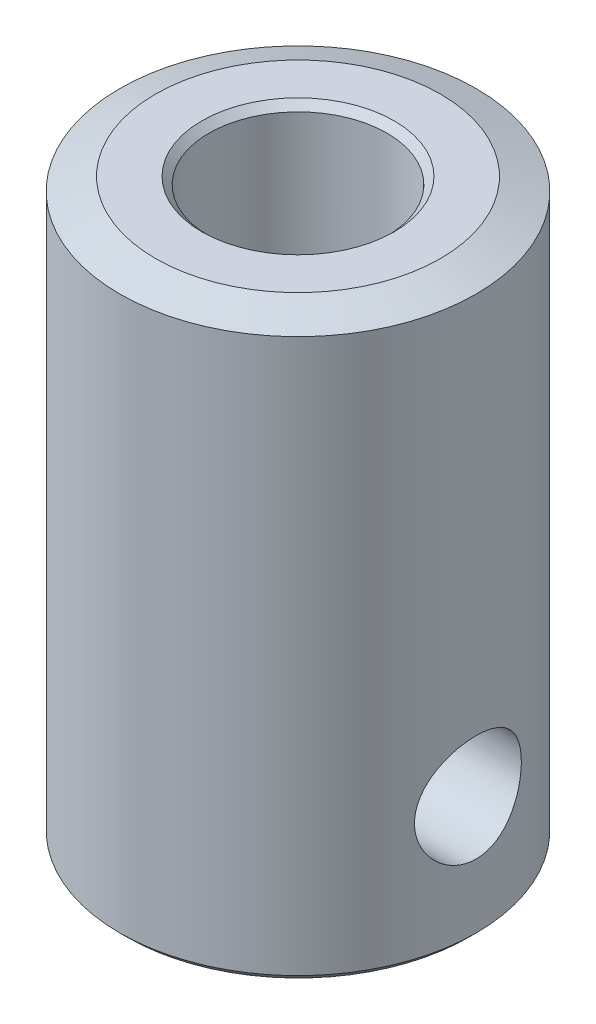
ISO-10303-21;
HEADER;
FILE_DESCRIPTION(('STEP AP214'),'2;1');
FILE_NAME('part.step','',(''),(''),'','','');
FILE_SCHEMA(('AUTOMOTIVE_DESIGN { 1 0 10303 214 1 1 1 1 }'));
ENDSEC;
DATA;
#1=APPLICATION_CONTEXT('core data for automotive mechanical design processes');
#2=APPLICATION_PROTOCOL_DEFINITION('international standard','automotive_design',2000,#1);
#3=PRODUCT_CONTEXT('',#1,'mechanical');
#4=PRODUCT('Part','Part','',(#3));
#5=PRODUCT_RELATED_PRODUCT_CATEGORY('part','',(#4));
#6=PRODUCT_DEFINITION_FORMATION('','',#4);
#7=PRODUCT_DEFINITION_CONTEXT('part definition',#1,'design');
#8=PRODUCT_DEFINITION('design','',#6,#7);
#9=PRODUCT_DEFINITION_SHAPE('','',#8);
#10=(LENGTH_UNIT() NAMED_UNIT(*) SI_UNIT(.MILLI.,.METRE.));
#11=(NAMED_UNIT(*) PLANE_ANGLE_UNIT() SI_UNIT($,.RADIAN.));
#12=(NAMED_UNIT(*) SI_UNIT($,.STERADIAN.) SOLID_ANGLE_UNIT());
#13=UNCERTAINTY_MEASURE_WITH_UNIT(LENGTH_MEASURE(1.E-05),#10,'distance_accuracy_value','');
#14=(GEOMETRIC_REPRESENTATION_CONTEXT(3) GLOBAL_UNCERTAINTY_ASSIGNED_CONTEXT((#13)) GLOBAL_UNIT_ASSIGNED_CONTEXT((#10,
#11,#12)) REPRESENTATION_CONTEXT('',''));
#15=CARTESIAN_POINT('',(0.,0.,0.));
#16=DIRECTION('',(0.,0.,1.));
#17=DIRECTION('',(1.,0.,0.));
#18=AXIS2_PLACEMENT_3D('',#15,#16,#17);
#19=CARTESIAN_POINT('',(0.,16.1,0.));
#20=DIRECTION('',(0.,1.,0.));
#21=DIRECTION('',(0.,0.,1.));
#22=AXIS2_PLACEMENT_3D('',#19,#20,#21);
#23=PLANE('',#22);
#24=CARTESIAN_POINT('',(0.,16.1,0.));
#25=DIRECTION('',(0.,1.,0.));
#26=DIRECTION('',(0.,0.,1.));
#27=AXIS2_PLACEMENT_3D('',#24,#25,#26);
#28=CIRCLE('',#27,3.99999999999999);
#29=CARTESIAN_POINT('',(0.,16.1,3.99999999999999));
#30=VERTEX_POINT('',#29);
#31=EDGE_CURVE('E38',#30,#30,#28,.T.);
#32=ORIENTED_EDGE('',*,*,#31,.T.);
#33=EDGE_LOOP('',(#32));
#34=FACE_BOUND('',#33,.T.);
#35=CARTESIAN_POINT('',(0.,16.1,0.));
#36=DIRECTION('',(0.,1.,0.));
#37=DIRECTION('',(0.,0.,1.));
#38=AXIS2_PLACEMENT_3D('',#35,#36,#37);
#39=CIRCLE('',#38,2.7);
#40=CARTESIAN_POINT('',(0.,16.1,2.7));
#41=VERTEX_POINT('',#40);
#42=EDGE_CURVE('E54',#41,#41,#39,.F.);
#43=ORIENTED_EDGE('',*,*,#42,.T.);
#44=EDGE_LOOP('',(#43));
#45=FACE_BOUND('',#44,.T.);
#46=ADVANCED_FACE('F31',(#34,#45),#23,.T.);
#47=CARTESIAN_POINT('',(0.,0.,0.));
#48=DIRECTION('',(0.,1.,0.));
#49=DIRECTION('',(0.,0.,1.));
#50=AXIS2_PLACEMENT_3D('',#47,#48,#49);
#51=PLANE('',#50);
#52=CARTESIAN_POINT('',(0.,0.,0.));
#53=DIRECTION('',(0.,1.,0.));
#54=DIRECTION('',(0.,0.,1.));
#55=AXIS2_PLACEMENT_3D('',#52,#53,#54);
#56=CIRCLE('',#55,2.7);
#57=CARTESIAN_POINT('',(0.,0.,2.7));
#58=VERTEX_POINT('',#57);
#59=EDGE_CURVE('E46',#58,#58,#56,.T.);
#60=ORIENTED_EDGE('',*,*,#59,.T.);
#61=EDGE_LOOP('',(#60));
#62=FACE_BOUND('',#61,.T.);
#63=CARTESIAN_POINT('',(0.,0.,0.));
#64=DIRECTION('',(0.,1.,0.));
#65=DIRECTION('',(0.,0.,1.));
#66=AXIS2_PLACEMENT_3D('',#63,#64,#65);
#67=CIRCLE('',#66,4.8);
#68=CARTESIAN_POINT('',(0.,0.,4.8));
#69=VERTEX_POINT('',#68);
#70=EDGE_CURVE('E51',#69,#69,#67,.F.);
#71=ORIENTED_EDGE('',*,*,#70,.T.);
#72=EDGE_LOOP('',(#71));
#73=FACE_BOUND('',#72,.T.);
#74=ADVANCED_FACE('F109',(#62,#73),#51,.F.);
#75=CARTESIAN_POINT('',(0.,16.1,0.));
#76=DIRECTION('',(0.,-1.,0.));
#77=DIRECTION('',(0.,0.,-1.));
#78=AXIS2_PLACEMENT_3D('',#75,#76,#77);
#79=CYLINDRICAL_SURFACE('',#78,5.);
#80=CARTESIAN_POINT('',(4.76969600708473,3.5,-1.49999999999998));
#81=CARTESIAN_POINT('',(4.7696968572698,3.5821945479424,-1.49999897633762));
#82=CARTESIAN_POINT('',(4.77184390209069,3.66439922414403,-1.4932210816714));
#83=CARTESIAN_POINT('',(4.780165783029,3.82640524959194,-1.46635844446747));
#84=CARTESIAN_POINT('',(4.78634196493468,3.90620578650147,-1.44626925573576));
#85=CARTESIAN_POINT('',(4.80196102485633,4.06103472827173,-1.39352753269954));
#86=CARTESIAN_POINT('',(4.81139846703233,4.13607082963309,-1.36089589394242));
#87=CARTESIAN_POINT('',(4.83246932547567,4.2796219339953,-1.28406421917927));
#88=CARTESIAN_POINT('',(4.8441030704102,4.34813595868444,-1.23986245137051));
#89=CARTESIAN_POINT('',(4.86866862185766,4.47886639057738,-1.13964754141625));
#90=CARTESIAN_POINT('',(4.88162808311636,4.54084589794629,-1.08333207175805));
#91=CARTESIAN_POINT('',(4.90714861936757,4.65463795132251,-0.961136237579581));
#92=CARTESIAN_POINT('',(4.91970964297705,4.70644919044988,-0.895254645461094));
#93=CARTESIAN_POINT('',(4.94333214579389,4.79946269983331,-0.754111437793673));
#94=CARTESIAN_POINT('',(4.95435724342404,4.84042342444281,-0.678684021335797));
#95=CARTESIAN_POINT('',(4.97334435920684,4.90898725904276,-0.521624645369336));
#96=CARTESIAN_POINT('',(4.98130703789496,4.93659324985745,-0.439994028387894));
#97=CARTESIAN_POINT('',(4.99307646003589,4.97688000109051,-0.275323852630812));
#98=CARTESIAN_POINT('',(4.99699557369339,4.9899651276527,-0.192391398953783));
#99=CARTESIAN_POINT('',(5.00063201501348,5.00211732464644,-0.0254218237492973));
#100=CARTESIAN_POINT('',(5.00035022521079,5.00118733940196,0.0586150620503859));
#101=CARTESIAN_POINT('',(4.99569603817658,4.98560713145698,0.222571156600178));
#102=CARTESIAN_POINT('',(4.9914542020526,4.97139480619013,0.302536267641359));
#103=CARTESIAN_POINT('',(4.97951522112593,4.93036866400571,0.458889213442544));
#104=CARTESIAN_POINT('',(4.97181785750586,4.90355404905733,0.535276821322864));
#105=CARTESIAN_POINT('',(4.95365220986963,4.83778797658144,0.683347326351298));
#106=CARTESIAN_POINT('',(4.94315269676706,4.79869879719273,0.754965064694495));
#107=CARTESIAN_POINT('',(4.92049640648069,4.70960214757177,0.890764673783173));
#108=CARTESIAN_POINT('',(4.90833923637777,4.65959208703652,0.954944774872148));
#109=CARTESIAN_POINT('',(4.88311550488165,4.5478022492484,1.07666048152982));
#110=CARTESIAN_POINT('',(4.87003195321461,4.48564308097026,1.13384458040113));
#111=CARTESIAN_POINT('',(4.84483979887497,4.35248998210995,1.23707651539825));
#112=CARTESIAN_POINT('',(4.83273129317019,4.28149517461077,1.28312324482854));
#113=CARTESIAN_POINT('',(4.81077903197677,4.13176053075101,1.36313995335452));
#114=CARTESIAN_POINT('',(4.80095810695956,4.05295295413708,1.39698989237681));
#115=CARTESIAN_POINT('',(4.78496392548435,3.89039279155446,1.45083362878415));
#116=CARTESIAN_POINT('',(4.77878947915829,3.80664182846544,1.47083194640562));
#117=CARTESIAN_POINT('',(4.77104849541241,3.63991763926072,1.49574770282167));
#118=CARTESIAN_POINT('',(4.7693187867044,3.55703177610602,1.50119946380214));
#119=CARTESIAN_POINT('',(4.77021192441923,3.39152709999013,1.49835947233064));
#120=CARTESIAN_POINT('',(4.77283416156589,3.30890825126915,1.49006964371332));
#121=CARTESIAN_POINT('',(4.78197558554912,3.14851162202913,1.46045763574192));
#122=CARTESIAN_POINT('',(4.78839176507488,3.07066383573648,1.43947961431282));
#123=CARTESIAN_POINT('',(4.80429141231227,2.91959830918508,1.38548577747942));
#124=CARTESIAN_POINT('',(4.81377535359073,2.84638128585943,1.35246810342761));
#125=CARTESIAN_POINT('',(4.83505835023047,2.70448253592787,1.27431871196502));
#126=CARTESIAN_POINT('',(4.84691271069798,2.63597527901421,1.22888564172731));
#127=CARTESIAN_POINT('',(4.87148205646987,2.5073618938192,1.12755301600386));
#128=CARTESIAN_POINT('',(4.88419724730003,2.44725778238721,1.07165095534898));
#129=CARTESIAN_POINT('',(4.90963633548158,2.33481959418526,0.948455132493616));
#130=CARTESIAN_POINT('',(4.92234245063004,2.28286437101302,0.880811065857451));
#131=CARTESIAN_POINT('',(4.9458485174865,2.19103329897225,0.737461784590266));
#132=CARTESIAN_POINT('',(4.95664856384717,2.15115685021854,0.661756970543961));
#133=CARTESIAN_POINT('',(4.97505970474957,2.0849999694317,0.504935504705238));
#134=CARTESIAN_POINT('',(4.98269453424965,2.05861798384102,0.423864622037856));
#135=CARTESIAN_POINT('',(4.99401979596827,2.01993908110958,0.258169966504605));
#136=CARTESIAN_POINT('',(4.9977113567088,2.00763813405158,0.17354721735478));
#137=CARTESIAN_POINT('',(5.00066544081399,1.9977769559455,0.00665215388276053));
#138=CARTESIAN_POINT('',(5.00009305111322,1.99966730459217,-0.0755851790861889));
#139=CARTESIAN_POINT('',(4.99497264465037,2.01682163249912,-0.238519481164386));
#140=CARTESIAN_POINT('',(4.99042485330463,2.03208485348044,-0.319216537346511));
#141=CARTESIAN_POINT('',(4.97791168358327,2.07521166139962,-0.475935813041341));
#142=CARTESIAN_POINT('',(4.96998352900866,2.10293818064901,-0.551998927351374));
#143=CARTESIAN_POINT('',(4.9515294303945,2.17008191450719,-0.698433237752036));
#144=CARTESIAN_POINT('',(4.94100305949946,2.20950105028619,-0.768803496050562));
#145=CARTESIAN_POINT('',(4.91803965828229,2.30037345743004,-0.904301892420546));
#146=CARTESIAN_POINT('',(4.9055522692356,2.35217143000077,-0.969190250076749));
#147=CARTESIAN_POINT('',(4.88023537212334,2.4657103883328,-1.08953757134593));
#148=CARTESIAN_POINT('',(4.86740576641079,2.52745423789815,-1.14499380960192));
#149=CARTESIAN_POINT('',(4.84240680631319,2.66134077831051,-1.24656269394547));
#150=CARTESIAN_POINT('',(4.83026852693486,2.73373855339044,-1.29234759757955));
#151=CARTESIAN_POINT('',(4.80852547508793,2.88555517416102,-1.37104313528774));
#152=CARTESIAN_POINT('',(4.79891948596956,2.96497062360119,-1.40395995557287));
#153=CARTESIAN_POINT('',(4.78427816717595,3.11974043160627,-1.45301942532948));
#154=CARTESIAN_POINT('',(4.77886154840521,3.19460864693099,-1.4705885901123));
#155=CARTESIAN_POINT('',(4.77157042597167,3.34631522249577,-1.49407818835142));
#156=CARTESIAN_POINT('',(4.76969521221431,3.42315318464525,-1.50000095706094));
#157=CARTESIAN_POINT('',(4.76969600708473,3.5,-1.49999999999998));
#158=B_SPLINE_CURVE_WITH_KNOTS('',3,(#80,#81,#82,#83,#84,#85,#86,#87,#88,#89,#90,#91,#92,#93,
#94,#95,#96,#97,#98,#99,#100,#101,#102,#103,#104,#105,#106,#107,#108,#109,#110,#111,#112,#113,
#114,#115,#116,#117,#118,#119,#120,#121,#122,#123,#124,#125,#126,#127,#128,#129,#130,#131,#132,
#133,#134,#135,#136,#137,#138,#139,#140,#141,#142,#143,#144,#145,#146,#147,#148,#149,#150,#151,
#152,#153,#154,#155,#156,#157),.UNSPECIFIED.,.T.,.F.,(4,2,2,2,2,2,2,2,2,2,2,2,2,2,2,2,2,2,2,2,2,
2,2,2,2,2,2,2,2,2,2,2,2,2,2,2,2,2,4),(0.,0.246300165915543,0.492682641689,0.738656414466194,
0.984667025370102,1.23773150007984,1.49082847871273,1.74915939273645,2.00743455587877,
2.25832140149558,2.5091555410144,2.7520012599088,2.99486235890376,3.24055209335676,
3.4863001659083,3.74152147023278,3.99676812491863,4.25446238246266,4.51207250628411,
4.76008080790309,5.00805439107388,5.24958594938817,5.49115481045787,5.73920731809388,
5.98731925928923,6.24479506100602,6.50225807324202,6.75775391814325,7.01317662321682,
7.2587630391122,7.50433553047754,7.74727096872219,7.99024634491378,8.24099627054488,
8.4918185262989,8.75011639669147,9.00828993963944,9.23861153857447,9.4688869503356),.UNSPECIFIED.);
#159=CARTESIAN_POINT('',(4.76969600708473,3.5,-1.49999999999998));
#160=VERTEX_POINT('',#159);
#161=EDGE_CURVE('E90',#160,#160,#158,.T.);
#162=ORIENTED_EDGE('',*,*,#161,.F.);
#163=EDGE_LOOP('',(#162));
#164=FACE_BOUND('',#163,.T.);
#165=CARTESIAN_POINT('',(-1.5,3.5,-4.76969600708473));
#166=CARTESIAN_POINT('',(-1.49999897633764,3.5821945479424,-4.7696968572698));
#167=CARTESIAN_POINT('',(-1.49322108167142,3.66439922414403,-4.77184390209069));
#168=CARTESIAN_POINT('',(-1.46635844446749,3.82640524959194,-4.780165783029));
#169=CARTESIAN_POINT('',(-1.44626925573578,3.90620578650147,-4.78634196493468));
#170=CARTESIAN_POINT('',(-1.39352753269955,4.06103472827173,-4.80196102485633));
#171=CARTESIAN_POINT('',(-1.36089589394243,4.13607082963309,-4.81139846703232));
#172=CARTESIAN_POINT('',(-1.28406421917929,4.2796219339953,-4.83246932547567));
#173=CARTESIAN_POINT('',(-1.23986245137053,4.34813595868444,-4.84410307041019));
#174=CARTESIAN_POINT('',(-1.13964754141627,4.47886639057738,-4.86866862185765));
#175=CARTESIAN_POINT('',(-1.08333207175807,4.54084589794629,-4.88162808311636));
#176=CARTESIAN_POINT('',(-0.961136237579598,4.65463795132251,-4.90714861936757));
#177=CARTESIAN_POINT('',(-0.895254645461111,4.70644919044988,-4.91970964297705));
#178=CARTESIAN_POINT('',(-0.754111437793689,4.79946269983331,-4.94333214579389));
#179=CARTESIAN_POINT('',(-0.678684021335814,4.84042342444281,-4.95435724342404));
#180=CARTESIAN_POINT('',(-0.521624645369353,4.90898725904276,-4.97334435920684));
#181=CARTESIAN_POINT('',(-0.439994028387911,4.93659324985745,-4.98130703789495));
#182=CARTESIAN_POINT('',(-0.275323852630828,4.97688000109051,-4.99307646003589));
#183=CARTESIAN_POINT('',(-0.1923913989538,4.9899651276527,-4.99699557369338));
#184=CARTESIAN_POINT('',(-0.0254218237493141,5.00211732464644,-5.00063201501348));
#185=CARTESIAN_POINT('',(0.0586150620503689,5.00118733940196,-5.00035022521079));
#186=CARTESIAN_POINT('',(0.222571156600161,4.98560713145698,-4.99569603817659));
#187=CARTESIAN_POINT('',(0.302536267641342,4.97139480619013,-4.9914542020526));
#188=CARTESIAN_POINT('',(0.458889213442527,4.93036866400571,-4.97951522112593));
#189=CARTESIAN_POINT('',(0.535276821322846,4.90355404905733,-4.97181785750586));
#190=CARTESIAN_POINT('',(0.683347326351281,4.83778797658144,-4.95365220986963));
#191=CARTESIAN_POINT('',(0.754965064694478,4.79869879719273,-4.94315269676706));
#192=CARTESIAN_POINT('',(0.890764673783156,4.70960214757177,-4.92049640648069));
#193=CARTESIAN_POINT('',(0.954944774872131,4.65959208703652,-4.90833923637778));
#194=CARTESIAN_POINT('',(1.0766604815298,4.5478022492484,-4.88311550488165));
#195=CARTESIAN_POINT('',(1.13384458040111,4.48564308097026,-4.87003195321461));
#196=CARTESIAN_POINT('',(1.23707651539824,4.35248998210995,-4.84483979887497));
#197=CARTESIAN_POINT('',(1.28312324482853,4.28149517461077,-4.8327312931702));
#198=CARTESIAN_POINT('',(1.3631399533545,4.13176053075101,-4.81077903197678));
#199=CARTESIAN_POINT('',(1.39698989237679,4.05295295413708,-4.80095810695957));
#200=CARTESIAN_POINT('',(1.45083362878413,3.89039279155446,-4.78496392548436));
#201=CARTESIAN_POINT('',(1.4708319464056,3.80664182846544,-4.7787894791583));
#202=CARTESIAN_POINT('',(1.49574770282165,3.63991763926072,-4.77104849541241));
#203=CARTESIAN_POINT('',(1.50119946380212,3.55703177610602,-4.7693187867044));
#204=CARTESIAN_POINT('',(1.49835947233062,3.39152709999013,-4.77021192441924));
#205=CARTESIAN_POINT('',(1.4900696437133,3.30890825126915,-4.77283416156589));
#206=CARTESIAN_POINT('',(1.4604576357419,3.14851162202913,-4.78197558554912));
#207=CARTESIAN_POINT('',(1.4394796143128,3.07066383573648,-4.78839176507489));
#208=CARTESIAN_POINT('',(1.3854857774794,2.91959830918508,-4.80429141231227));
#209=CARTESIAN_POINT('',(1.3524681034276,2.84638128585943,-4.81377535359073));
#210=CARTESIAN_POINT('',(1.274318711965,2.70448253592787,-4.83505835023047));
#211=CARTESIAN_POINT('',(1.22888564172729,2.63597527901421,-4.84691271069799));
#212=CARTESIAN_POINT('',(1.12755301600385,2.5073618938192,-4.87148205646987));
#213=CARTESIAN_POINT('',(1.07165095534897,2.44725778238721,-4.88419724730003));
#214=CARTESIAN_POINT('',(0.948455132493599,2.33481959418526,-4.90963633548158));
#215=CARTESIAN_POINT('',(0.880811065857434,2.28286437101302,-4.92234245063004));
#216=CARTESIAN_POINT('',(0.737461784590249,2.19103329897225,-4.94584851748651));
#217=CARTESIAN_POINT('',(0.661756970543944,2.15115685021854,-4.95664856384717));
#218=CARTESIAN_POINT('',(0.504935504705221,2.0849999694317,-4.97505970474957));
#219=CARTESIAN_POINT('',(0.423864622037839,2.05861798384102,-4.98269453424966));
#220=CARTESIAN_POINT('',(0.258169966504588,2.01993908110958,-4.99401979596827));
#221=CARTESIAN_POINT('',(0.173547217354763,2.00763813405158,-4.9977113567088));
#222=CARTESIAN_POINT('',(0.00665215388274322,1.9977769559455,-5.00066544081399));
#223=CARTESIAN_POINT('',(-0.075585179086206,1.99966730459217,-5.00009305111322));
#224=CARTESIAN_POINT('',(-0.238519481164403,2.01682163249912,-4.99497264465037));
#225=CARTESIAN_POINT('',(-0.319216537346528,2.03208485348044,-4.99042485330463));
#226=CARTESIAN_POINT('',(-0.475935813041358,2.07521166139962,-4.97791168358327));
#227=CARTESIAN_POINT('',(-0.551998927351391,2.10293818064901,-4.96998352900866));
#228=CARTESIAN_POINT('',(-0.698433237752052,2.17008191450719,-4.9515294303945));
#229=CARTESIAN_POINT('',(-0.768803496050579,2.20950105028619,-4.94100305949946));
#230=CARTESIAN_POINT('',(-0.904301892420563,2.30037345743004,-4.91803965828228));
#231=CARTESIAN_POINT('',(-0.969190250076767,2.35217143000077,-4.90555226923559));
#232=CARTESIAN_POINT('',(-1.08953757134594,2.4657103883328,-4.88023537212334));
#233=CARTESIAN_POINT('',(-1.14499380960194,2.52745423789815,-4.86740576641079));
#234=CARTESIAN_POINT('',(-1.24656269394549,2.66134077831051,-4.84240680631319));
#235=CARTESIAN_POINT('',(-1.29234759757956,2.73373855339044,-4.83026852693485));
#236=CARTESIAN_POINT('',(-1.37104313528776,2.88555517416102,-4.80852547508793));
#237=CARTESIAN_POINT('',(-1.40395995557289,2.96497062360119,-4.79891948596956));
#238=CARTESIAN_POINT('',(-1.4530194253295,3.11974043160627,-4.78427816717595));
#239=CARTESIAN_POINT('',(-1.47058859011232,3.19460864693099,-4.7788615484052));
#240=CARTESIAN_POINT('',(-1.49407818835144,3.34631522249577,-4.77157042597167));
#241=CARTESIAN_POINT('',(-1.50000095706095,3.42315318464525,-4.7696952122143));
#242=CARTESIAN_POINT('',(-1.5,3.5,-4.76969600708473));
#243=B_SPLINE_CURVE_WITH_KNOTS('',3,(#165,#166,#167,#168,#169,#170,#171,#172,#173,#174,#175,
#176,#177,#178,#179,#180,#181,#182,#183,#184,#185,#186,#187,#188,#189,#190,#191,#192,#193,#194,
#195,#196,#197,#198,#199,#200,#201,#202,#203,#204,#205,#206,#207,#208,#209,#210,#211,#212,#213,
#214,#215,#216,#217,#218,#219,#220,#221,#222,#223,#224,#225,#226,#227,#228,#229,#230,#231,#232,
#233,#234,#235,#236,#237,#238,#239,#240,#241,#242),.UNSPECIFIED.,.T.,.F.,(4,2,2,2,2,2,2,2,2,2,2,
2,2,2,2,2,2,2,2,2,2,2,2,2,2,2,2,2,2,2,2,2,2,2,2,2,2,2,4),(0.,0.246300165915543,0.492682641689,
0.738656414466194,0.984667025370101,1.23773150007984,1.49082847871273,1.74915939273645,
2.00743455587877,2.25832140149558,2.5091555410144,2.7520012599088,2.99486235890376,
3.24055209335676,3.4863001659083,3.74152147023278,3.99676812491863,4.25446238246266,
4.51207250628411,4.76008080790309,5.00805439107388,5.24958594938817,5.49115481045787,
5.73920731809388,5.98731925928923,6.24479506100602,6.50225807324202,6.75775391814325,
7.01317662321682,7.2587630391122,7.50433553047755,7.74727096872219,7.99024634491378,
8.24099627054488,8.4918185262989,8.75011639669147,9.00828993963944,9.23861153857448,
9.4688869503356),.UNSPECIFIED.);
#244=CARTESIAN_POINT('',(-1.5,3.5,-4.76969600708473));
#245=VERTEX_POINT('',#244);
#246=EDGE_CURVE('E70',#245,#245,#243,.T.);
#247=ORIENTED_EDGE('',*,*,#246,.F.);
#248=EDGE_LOOP('',(#247));
#249=FACE_BOUND('',#248,.T.);
#250=CARTESIAN_POINT('',(0.,15.7360297657338,0.));
#251=DIRECTION('',(0.,1.,0.));
#252=DIRECTION('',(0.,0.,1.));
#253=AXIS2_PLACEMENT_3D('',#250,#251,#252);
#254=CIRCLE('',#253,5.);
#255=CARTESIAN_POINT('',(0.,15.7360297657338,5.));
#256=VERTEX_POINT('',#255);
#257=EDGE_CURVE('E10',#256,#256,#254,.F.);
#258=ORIENTED_EDGE('',*,*,#257,.T.);
#259=EDGE_LOOP('',(#258));
#260=FACE_BOUND('',#259,.T.);
#261=CARTESIAN_POINT('',(0.,0.199999999999995,0.));
#262=DIRECTION('',(0.,1.,0.));
#263=DIRECTION('',(0.,0.,1.));
#264=AXIS2_PLACEMENT_3D('',#261,#262,#263);
#265=CIRCLE('',#264,5.);
#266=CARTESIAN_POINT('',(0.,0.199999999999995,5.));
#267=VERTEX_POINT('',#266);
#268=EDGE_CURVE('E42',#267,#267,#265,.T.);
#269=ORIENTED_EDGE('',*,*,#268,.T.);
#270=EDGE_LOOP('',(#269));
#271=FACE_BOUND('',#270,.T.);
#272=ADVANCED_FACE('F105',(#164,#249,#260,#271),#79,.T.);
#273=CARTESIAN_POINT('',(0.,16.1,0.));
#274=DIRECTION('',(0.,-1.,0.));
#275=DIRECTION('',(0.,0.,-1.));
#276=AXIS2_PLACEMENT_3D('',#273,#274,#275);
#277=CYLINDRICAL_SURFACE('',#276,2.5);
#278=CARTESIAN_POINT('',(2.,3.5,-1.49999999999999));
#279=CARTESIAN_POINT('',(1.99999416642512,3.57547897528964,-1.50000404108591));
#280=CARTESIAN_POINT('',(2.00433633903482,3.6509384340798,-1.49426852824013));
#281=CARTESIAN_POINT('',(2.02092590613883,3.79932390396222,-1.47174965152787));
#282=CARTESIAN_POINT('',(2.03318155043098,3.8722471873851,-1.45495475788935));
#283=CARTESIAN_POINT('',(2.0636233903473,4.01308364167728,-1.41143486335795));
#284=CARTESIAN_POINT('',(2.0817666618312,4.08102883803527,-1.38478154503149));
#285=CARTESIAN_POINT('',(2.12185904995836,4.21143745336792,-1.32252909283019));
#286=CARTESIAN_POINT('',(2.14380930122416,4.27389922969514,-1.28692729054693));
#287=CARTESIAN_POINT('',(2.19228594587543,4.39994901666408,-1.20271292747643));
#288=CARTESIAN_POINT('',(2.21904371037663,4.46274095712394,-1.15304179435288));
#289=CARTESIAN_POINT('',(2.27226229431061,4.57976476274175,-1.04426801309984));
#290=CARTESIAN_POINT('',(2.29872287517103,4.6339901516708,-0.985158296729604));
#291=CARTESIAN_POINT('',(2.35175567858734,4.7381338097097,-0.851442367411693));
#292=CARTESIAN_POINT('',(2.37803133577818,4.78695446366975,-0.775851995162539));
#293=CARTESIAN_POINT('',(2.42443786983179,4.87080972244443,-0.61565422827165));
#294=CARTESIAN_POINT('',(2.44457437988735,4.90585697412271,-0.531055196626322));
#295=CARTESIAN_POINT('',(2.4747098780044,4.95759592281265,-0.363771406742658));
#296=CARTESIAN_POINT('',(2.4854930393917,4.9757203609673,-0.281674698130907));
#297=CARTESIAN_POINT('',(2.49874939277545,4.99794280286312,-0.1149705093827));
#298=CARTESIAN_POINT('',(2.50123038813307,5.00205397800005,-0.0303654624001446));
#299=CARTESIAN_POINT('',(2.49783372711539,4.99638625265754,0.127637283737319));
#300=CARTESIAN_POINT('',(2.49295437513726,4.98826647383069,0.201123832865644));
#301=CARTESIAN_POINT('',(2.47707997553857,4.96152020435189,0.345464269151777));
#302=CARTESIAN_POINT('',(2.46608447529309,4.94289293609285,0.416317961051211));
#303=CARTESIAN_POINT('',(2.43884907201719,4.89583443729622,0.554056780469088));
#304=CARTESIAN_POINT('',(2.42257910450823,4.867346938861,0.620916491037626));
#305=CARTESIAN_POINT('',(2.38609637638748,4.80161538377446,0.748988660115619));
#306=CARTESIAN_POINT('',(2.36588259201812,4.76436905294099,0.81019964620802));
#307=CARTESIAN_POINT('',(2.32037925976362,4.67716090719555,0.933074267143208));
#308=CARTESIAN_POINT('',(2.2947718295215,4.62621168826426,0.993918663198201));
#309=CARTESIAN_POINT('',(2.24255554245601,4.51559588213982,1.10671465909275));
#310=CARTESIAN_POINT('',(2.21594536703375,4.45591749652549,1.1586540130834));
#311=CARTESIAN_POINT('',(2.16111075123945,4.32134659383645,1.25824837767418));
#312=CARTESIAN_POINT('',(2.13305661385124,4.24549242346054,1.30470933188633));
#313=CARTESIAN_POINT('',(2.08250879557267,4.08529376836339,1.38397217194233));
#314=CARTESIAN_POINT('',(2.0600049029882,4.00096528387436,1.4167992196219));
#315=CARTESIAN_POINT('',(2.02895865196731,3.84760636810465,1.46077497064843));
#316=CARTESIAN_POINT('',(2.01833888618315,3.77995936770336,1.47527903312666));
#317=CARTESIAN_POINT('',(2.00392150777557,3.64262638970052,1.49480872755285));
#318=CARTESIAN_POINT('',(2.00011596115116,3.57294287951544,1.49984538302908));
#319=CARTESIAN_POINT('',(1.99988914321323,3.43344831756429,1.50014781114183));
#320=CARTESIAN_POINT('',(2.00347810223984,3.36363722278479,1.49540004697659));
#321=CARTESIAN_POINT('',(2.01751520788651,3.22601265625144,1.47640290574942));
#322=CARTESIAN_POINT('',(2.02796877613212,3.15820080775975,1.4621460183014));
#323=CARTESIAN_POINT('',(2.054317683331,3.02628542052021,1.42488312618658));
#324=CARTESIAN_POINT('',(2.07020622092811,2.96217736346777,1.40188805257363));
#325=CARTESIAN_POINT('',(2.10571539417586,2.83852228426982,1.34796261057073));
#326=CARTESIAN_POINT('',(2.12533743689998,2.778976993634,1.31702924888213));
#327=CARTESIAN_POINT('',(2.17036819177736,2.65475991748775,1.24167439558513));
#328=CARTESIAN_POINT('',(2.19618239397369,2.59109916490343,1.19582663060303));
#329=CARTESIAN_POINT('',(2.2482175480362,2.47171451515054,1.09487395518701));
#330=CARTESIAN_POINT('',(2.27443886711454,2.41599830783088,1.03976018672403));
#331=CARTESIAN_POINT('',(2.32835625910913,2.30677599264957,0.913274837212775));
#332=CARTESIAN_POINT('',(2.3558007587587,2.25449927339416,0.8407211087802));
#333=CARTESIAN_POINT('',(2.40537639133458,2.16309722316335,0.686103100868029));
#334=CARTESIAN_POINT('',(2.4275110444941,2.12396317215908,0.604045176134711));
#335=CARTESIAN_POINT('',(2.46252280092775,2.06313179656863,0.438840232972147));
#336=CARTESIAN_POINT('',(2.47595588067329,2.04037377220889,0.356205963651267));
#337=CARTESIAN_POINT('',(2.494407389061,2.00928539715374,0.187383063890866));
#338=CARTESIAN_POINT('',(2.49943534582737,2.00093870928238,0.101198571781978));
#339=CARTESIAN_POINT('',(2.50040600461976,1.99932539141407,-0.0598120232009747));
#340=CARTESIAN_POINT('',(2.49747057186327,2.00419666543697,-0.134620583589697));
#341=CARTESIAN_POINT('',(2.48512948412096,2.02489382438162,-0.282148755978764));
#342=CARTESIAN_POINT('',(2.47572375706639,2.0407198313216,-0.354868344701905));
#343=CARTESIAN_POINT('',(2.45149427526962,2.08221957158379,-0.495145481978788));
#344=CARTESIAN_POINT('',(2.43675966858906,2.10773159612924,-0.562767032608822));
#345=CARTESIAN_POINT('',(2.40303337447155,2.16764059455475,-0.692781971999976));
#346=CARTESIAN_POINT('',(2.38404073252268,2.2020395608596,-0.755174184199824));
#347=CARTESIAN_POINT('',(2.34093432659381,2.28292519656876,-0.880263645295939));
#348=CARTESIAN_POINT('',(2.31648844639149,2.33031870901687,-0.942258690439932));
#349=CARTESIAN_POINT('',(2.26601907350661,2.43375303371772,-1.05789751536306));
#350=CARTESIAN_POINT('',(2.23999385274509,2.48980342560791,-1.11153190956915));
#351=CARTESIAN_POINT('',(2.18528165666205,2.6172855621777,-1.21590975350569));
#352=CARTESIAN_POINT('',(2.15667566270901,2.6897664861655,-1.26542406663367));
#353=CARTESIAN_POINT('',(2.10376464485146,2.84348485276654,-1.35156817210324));
#354=CARTESIAN_POINT('',(2.07945738811052,2.92471771398141,-1.3882046632266));
#355=CARTESIAN_POINT('',(2.04080003047961,3.0870642851372,-1.44437116535131));
#356=CARTESIAN_POINT('',(2.02577665830139,3.16759523596125,-1.46509526060187));
#357=CARTESIAN_POINT('',(2.00539032320037,3.33209739470368,-1.49289268240426));
#358=CARTESIAN_POINT('',(2.00000648744643,3.41606076575871,-1.49999550595836));
#359=CARTESIAN_POINT('',(2.,3.5,-1.49999999999999));
#360=B_SPLINE_CURVE_WITH_KNOTS('',3,(#278,#279,#280,#281,#282,#283,#284,#285,#286,#287,#288,
#289,#290,#291,#292,#293,#294,#295,#296,#297,#298,#299,#300,#301,#302,#303,#304,#305,#306,#307,
#308,#309,#310,#311,#312,#313,#314,#315,#316,#317,#318,#319,#320,#321,#322,#323,#324,#325,#326,
#327,#328,#329,#330,#331,#332,#333,#334,#335,#336,#337,#338,#339,#340,#341,#342,#343,#344,#345,
#346,#347,#348,#349,#350,#351,#352,#353,#354,#355,#356,#357,#358,#359),.UNSPECIFIED.,.T.,.F.,(4,
2,2,2,2,2,2,2,2,2,2,2,2,2,2,2,2,2,2,2,2,2,2,2,2,2,2,2,2,2,2,2,2,2,2,2,2,2,2,2,4),(0.,
0.226085249493392,0.45240657433077,0.677113624991876,0.901887762215932,1.15414462390001,
1.40659128601844,1.68630157736223,1.9657544327122,2.21853330858497,2.47107452602766,
2.69230130543182,2.91354445887944,3.13607155036377,3.35865648368878,3.60782810055849,
3.85733966656908,4.13576671140276,4.41367760154768,4.62276298054684,4.83160475643976,
5.04073566011181,5.25003193304128,5.45906724365495,5.66818149154661,5.91499438482002,
6.16204457978454,6.44121828011588,6.72020638384847,6.97891479383337,7.23732973022726,
7.46129321849399,7.68525920139648,7.90563970188756,8.12606965394584,8.37042963549487,
8.61506198741955,8.89071695766604,9.16622832484805,9.41820120134354,9.66962780912277),.UNSPECIFIED.);
#361=CARTESIAN_POINT('',(2.,3.5,-1.49999999999999));
#362=VERTEX_POINT('',#361);
#363=EDGE_CURVE('E93',#362,#362,#360,.T.);
#364=ORIENTED_EDGE('',*,*,#363,.T.);
#365=EDGE_LOOP('',(#364));
#366=FACE_BOUND('',#365,.T.);
#367=CARTESIAN_POINT('',(-1.5,3.5,-2.));
#368=CARTESIAN_POINT('',(-1.50000404108592,3.57547897528964,-1.99999416642511));
#369=CARTESIAN_POINT('',(-1.49426852824013,3.6509384340798,-2.00433633903481));
#370=CARTESIAN_POINT('',(-1.47174965152787,3.79932390396222,-2.02092590613883));
#371=CARTESIAN_POINT('',(-1.45495475788936,3.8722471873851,-2.03318155043097));
#372=CARTESIAN_POINT('',(-1.41143486335795,4.01308364167728,-2.0636233903473));
#373=CARTESIAN_POINT('',(-1.3847815450315,4.08102883803527,-2.0817666618312));
#374=CARTESIAN_POINT('',(-1.32252909283019,4.21143745336792,-2.12185904995836));
#375=CARTESIAN_POINT('',(-1.28692729054693,4.27389922969514,-2.14380930122416));
#376=CARTESIAN_POINT('',(-1.20271292747644,4.39994901666408,-2.19228594587542));
#377=CARTESIAN_POINT('',(-1.15304179435289,4.46274095712394,-2.21904371037662));
#378=CARTESIAN_POINT('',(-1.04426801309985,4.57976476274175,-2.27226229431061));
#379=CARTESIAN_POINT('',(-0.985158296729612,4.6339901516708,-2.29872287517103));
#380=CARTESIAN_POINT('',(-0.851442367411701,4.7381338097097,-2.35175567858734));
#381=CARTESIAN_POINT('',(-0.775851995162548,4.78695446366975,-2.37803133577818));
#382=CARTESIAN_POINT('',(-0.615654228271658,4.87080972244443,-2.42443786983179));
#383=CARTESIAN_POINT('',(-0.531055196626331,4.90585697412271,-2.44457437988735));
#384=CARTESIAN_POINT('',(-0.363771406742666,4.95759592281265,-2.4747098780044));
#385=CARTESIAN_POINT('',(-0.281674698130915,4.9757203609673,-2.4854930393917));
#386=CARTESIAN_POINT('',(-0.114970509382708,4.99794280286312,-2.49874939277545));
#387=CARTESIAN_POINT('',(-0.030365462400153,5.00205397800005,-2.50123038813307));
#388=CARTESIAN_POINT('',(0.12763728373731,4.99638625265754,-2.49783372711539));
#389=CARTESIAN_POINT('',(0.201123832865635,4.98826647383069,-2.49295437513726));
#390=CARTESIAN_POINT('',(0.345464269151769,4.96152020435189,-2.47707997553857));
#391=CARTESIAN_POINT('',(0.416317961051202,4.94289293609285,-2.46608447529309));
#392=CARTESIAN_POINT('',(0.55405678046908,4.89583443729622,-2.43884907201719));
#393=CARTESIAN_POINT('',(0.620916491037618,4.867346938861,-2.42257910450824));
#394=CARTESIAN_POINT('',(0.748988660115612,4.80161538377446,-2.38609637638748));
#395=CARTESIAN_POINT('',(0.810199646208012,4.76436905294099,-2.36588259201812));
#396=CARTESIAN_POINT('',(0.9330742671432,4.67716090719555,-2.32037925976362));
#397=CARTESIAN_POINT('',(0.993918663198194,4.62621168826426,-2.2947718295215));
#398=CARTESIAN_POINT('',(1.10671465909275,4.51559588213982,-2.24255554245601));
#399=CARTESIAN_POINT('',(1.1586540130834,4.45591749652549,-2.21594536703375));
#400=CARTESIAN_POINT('',(1.25824837767417,4.32134659383645,-2.16111075123946));
#401=CARTESIAN_POINT('',(1.30470933188632,4.24549242346054,-2.13305661385124));
#402=CARTESIAN_POINT('',(1.38397217194232,4.08529376836339,-2.08250879557267));
#403=CARTESIAN_POINT('',(1.41679921962189,4.00096528387436,-2.0600049029882));
#404=CARTESIAN_POINT('',(1.46077497064842,3.84760636810465,-2.02895865196731));
#405=CARTESIAN_POINT('',(1.47527903312665,3.77995936770336,-2.01833888618316));
#406=CARTESIAN_POINT('',(1.49480872755284,3.64262638970052,-2.00392150777558));
#407=CARTESIAN_POINT('',(1.49984538302907,3.57294287951544,-2.00011596115116));
#408=CARTESIAN_POINT('',(1.50014781114183,3.43344831756429,-1.99988914321323));
#409=CARTESIAN_POINT('',(1.49540004697659,3.36363722278479,-2.00347810223984));
#410=CARTESIAN_POINT('',(1.47640290574941,3.22601265625144,-2.01751520788652));
#411=CARTESIAN_POINT('',(1.46214601830139,3.15820080775975,-2.02796877613213));
#412=CARTESIAN_POINT('',(1.42488312618657,3.02628542052021,-2.054317683331));
#413=CARTESIAN_POINT('',(1.40188805257362,2.96217736346777,-2.07020622092812));
#414=CARTESIAN_POINT('',(1.34796261057072,2.83852228426982,-2.10571539417587));
#415=CARTESIAN_POINT('',(1.31702924888212,2.778976993634,-2.12533743689999));
#416=CARTESIAN_POINT('',(1.24167439558512,2.65475991748775,-2.17036819177737));
#417=CARTESIAN_POINT('',(1.19582663060303,2.59109916490343,-2.19618239397369));
#418=CARTESIAN_POINT('',(1.09487395518701,2.47171451515054,-2.2482175480362));
#419=CARTESIAN_POINT('',(1.03976018672402,2.41599830783088,-2.27443886711455));
#420=CARTESIAN_POINT('',(0.913274837212766,2.30677599264957,-2.32835625910913));
#421=CARTESIAN_POINT('',(0.840721108780191,2.25449927339416,-2.3558007587587));
#422=CARTESIAN_POINT('',(0.68610310086802,2.16309722316335,-2.40537639133459));
#423=CARTESIAN_POINT('',(0.604045176134703,2.12396317215908,-2.42751104449411));
#424=CARTESIAN_POINT('',(0.438840232972138,2.06313179656863,-2.46252280092775));
#425=CARTESIAN_POINT('',(0.356205963651258,2.04037377220889,-2.47595588067329));
#426=CARTESIAN_POINT('',(0.187383063890857,2.00928539715374,-2.494407389061));
#427=CARTESIAN_POINT('',(0.101198571781969,2.00093870928238,-2.49943534582737));
#428=CARTESIAN_POINT('',(-0.059812023200984,1.99932539141407,-2.50040600461976));
#429=CARTESIAN_POINT('',(-0.134620583589706,2.00419666543697,-2.49747057186327));
#430=CARTESIAN_POINT('',(-0.282148755978774,2.02489382438162,-2.48512948412095));
#431=CARTESIAN_POINT('',(-0.354868344701914,2.0407198313216,-2.47572375706639));
#432=CARTESIAN_POINT('',(-0.495145481978797,2.08221957158379,-2.45149427526962));
#433=CARTESIAN_POINT('',(-0.56276703260883,2.10773159612924,-2.43675966858906));
#434=CARTESIAN_POINT('',(-0.692781971999984,2.16764059455475,-2.40303337447155));
#435=CARTESIAN_POINT('',(-0.755174184199832,2.2020395608596,-2.38404073252268));
#436=CARTESIAN_POINT('',(-0.880263645295947,2.28292519656876,-2.34093432659381));
#437=CARTESIAN_POINT('',(-0.94225869043994,2.33031870901687,-2.31648844639149));
#438=CARTESIAN_POINT('',(-1.05789751536307,2.43375303371772,-2.26601907350661));
#439=CARTESIAN_POINT('',(-1.11153190956916,2.48980342560791,-2.23999385274509));
#440=CARTESIAN_POINT('',(-1.2159097535057,2.6172855621777,-2.18528165666204));
#441=CARTESIAN_POINT('',(-1.26542406663367,2.6897664861655,-2.15667566270901));
#442=CARTESIAN_POINT('',(-1.35156817210325,2.84348485276654,-2.10376464485145));
#443=CARTESIAN_POINT('',(-1.38820466322661,2.92471771398141,-2.07945738811052));
#444=CARTESIAN_POINT('',(-1.44437116535132,3.0870642851372,-2.0408000304796));
#445=CARTESIAN_POINT('',(-1.46509526060187,3.16759523596125,-2.02577665830138));
#446=CARTESIAN_POINT('',(-1.49289268240426,3.33209739470368,-2.00539032320036));
#447=CARTESIAN_POINT('',(-1.49999550595837,3.41606076575871,-2.00000648744643));
#448=CARTESIAN_POINT('',(-1.5,3.5,-2.));
#449=B_SPLINE_CURVE_WITH_KNOTS('',3,(#367,#368,#369,#370,#371,#372,#373,#374,#375,#376,#377,
#378,#379,#380,#381,#382,#383,#384,#385,#386,#387,#388,#389,#390,#391,#392,#393,#394,#395,#396,
#397,#398,#399,#400,#401,#402,#403,#404,#405,#406,#407,#408,#409,#410,#411,#412,#413,#414,#415,
#416,#417,#418,#419,#420,#421,#422,#423,#424,#425,#426,#427,#428,#429,#430,#431,#432,#433,#434,
#435,#436,#437,#438,#439,#440,#441,#442,#443,#444,#445,#446,#447,#448),.UNSPECIFIED.,.T.,.F.,(4,
2,2,2,2,2,2,2,2,2,2,2,2,2,2,2,2,2,2,2,2,2,2,2,2,2,2,2,2,2,2,2,2,2,2,2,2,2,2,2,4),(0.,
0.226085249493392,0.45240657433077,0.677113624991876,0.901887762215932,1.15414462390001,
1.40659128601844,1.68630157736223,1.9657544327122,2.21853330858497,2.47107452602767,
2.69230130543182,2.91354445887944,3.13607155036377,3.35865648368878,3.60782810055849,
3.85733966656908,4.13576671140276,4.41367760154768,4.62276298054684,4.83160475643976,
5.04073566011181,5.25003193304128,5.45906724365495,5.66818149154661,5.91499438482002,
6.16204457978455,6.44121828011588,6.72020638384847,6.97891479383337,7.23732973022726,
7.46129321849399,7.68525920139648,7.90563970188756,8.12606965394584,8.37042963549487,
8.61506198741955,8.89071695766604,9.16622832484805,9.41820120134354,9.66962780912277),.UNSPECIFIED.);
#450=CARTESIAN_POINT('',(-1.5,3.5,-2.));
#451=VERTEX_POINT('',#450);
#452=EDGE_CURVE('E63',#451,#451,#449,.T.);
#453=ORIENTED_EDGE('',*,*,#452,.T.);
#454=EDGE_LOOP('',(#453));
#455=FACE_BOUND('',#454,.T.);
#456=CARTESIAN_POINT('',(0.,15.9,0.));
#457=DIRECTION('',(0.,1.,0.));
#458=DIRECTION('',(0.,0.,1.));
#459=AXIS2_PLACEMENT_3D('',#456,#457,#458);
#460=CIRCLE('',#459,2.5);
#461=CARTESIAN_POINT('',(0.,15.9,2.5));
#462=VERTEX_POINT('',#461);
#463=EDGE_CURVE('E57',#462,#462,#460,.T.);
#464=ORIENTED_EDGE('',*,*,#463,.T.);
#465=EDGE_LOOP('',(#464));
#466=FACE_BOUND('',#465,.T.);
#467=CARTESIAN_POINT('',(0.,0.199999999999999,0.));
#468=DIRECTION('',(0.,1.,0.));
#469=DIRECTION('',(0.,0.,1.));
#470=AXIS2_PLACEMENT_3D('',#467,#468,#469);
#471=CIRCLE('',#470,2.5);
#472=CARTESIAN_POINT('',(0.,0.199999999999999,2.5));
#473=VERTEX_POINT('',#472);
#474=EDGE_CURVE('E60',#473,#473,#471,.F.);
#475=ORIENTED_EDGE('',*,*,#474,.T.);
#476=EDGE_LOOP('',(#475));
#477=FACE_BOUND('',#476,.T.);
#478=ADVANCED_FACE('F108',(#366,#455,#466,#477),#277,.F.);
#479=CARTESIAN_POINT('',(0.,15.9,0.));
#480=DIRECTION('',(0.,1.,0.));
#481=DIRECTION('',(0.,0.,1.));
#482=AXIS2_PLACEMENT_3D('',#479,#480,#481);
#483=CONICAL_SURFACE('',#482,2.5,0.785398163397454);
#484=ORIENTED_EDGE('',*,*,#42,.F.);
#485=EDGE_LOOP('',(#484));
#486=FACE_BOUND('',#485,.T.);
#487=ORIENTED_EDGE('',*,*,#463,.F.);
#488=EDGE_LOOP('',(#487));
#489=FACE_BOUND('',#488,.T.);
#490=ADVANCED_FACE('F124',(#486,#489),#483,.F.);
#491=CARTESIAN_POINT('',(0.,0.,0.));
#492=DIRECTION('',(0.,-1.,0.));
#493=DIRECTION('',(0.,0.,-1.));
#494=AXIS2_PLACEMENT_3D('',#491,#492,#493);
#495=CONICAL_SURFACE('',#494,2.7,0.785398163397449);
#496=ORIENTED_EDGE('',*,*,#474,.F.);
#497=EDGE_LOOP('',(#496));
#498=FACE_BOUND('',#497,.T.);
#499=ORIENTED_EDGE('',*,*,#59,.F.);
#500=EDGE_LOOP('',(#499));
#501=FACE_BOUND('',#500,.T.);
#502=ADVANCED_FACE('F117',(#498,#501),#495,.F.);
#503=CARTESIAN_POINT('',(0.,0.199999999999995,0.));
#504=DIRECTION('',(0.,1.,0.));
#505=DIRECTION('',(0.,0.,1.));
#506=AXIS2_PLACEMENT_3D('',#503,#504,#505);
#507=CONICAL_SURFACE('',#506,5.,0.785398163397455);
#508=ORIENTED_EDGE('',*,*,#70,.F.);
#509=EDGE_LOOP('',(#508));
#510=FACE_BOUND('',#509,.T.);
#511=ORIENTED_EDGE('',*,*,#268,.F.);
#512=EDGE_LOOP('',(#511));
#513=FACE_BOUND('',#512,.T.);
#514=ADVANCED_FACE('F115',(#510,#513),#507,.T.);
#515=CARTESIAN_POINT('',(0.,16.1,0.));
#516=DIRECTION('',(0.,-1.,0.));
#517=DIRECTION('',(0.,0.,-1.));
#518=AXIS2_PLACEMENT_3D('',#515,#516,#517);
#519=CONICAL_SURFACE('',#518,3.99999999999999,1.22173047639603);
#520=ORIENTED_EDGE('',*,*,#257,.F.);
#521=EDGE_LOOP('',(#520));
#522=FACE_BOUND('',#521,.T.);
#523=ORIENTED_EDGE('',*,*,#31,.F.);
#524=EDGE_LOOP('',(#523));
#525=FACE_BOUND('',#524,.T.);
#526=ADVANCED_FACE('F33',(#522,#525),#519,.T.);
#527=CARTESIAN_POINT('',(0.,3.5,5.001));
#528=DIRECTION('',(0.,0.,-1.));
#529=DIRECTION('',(-1.,0.,0.));
#530=AXIS2_PLACEMENT_3D('',#527,#528,#529);
#531=CYLINDRICAL_SURFACE('',#530,1.5);
#532=ORIENTED_EDGE('',*,*,#452,.F.);
#533=EDGE_LOOP('',(#532));
#534=FACE_BOUND('',#533,.T.);
#535=ORIENTED_EDGE('',*,*,#246,.T.);
#536=EDGE_LOOP('',(#535));
#537=FACE_BOUND('',#536,.T.);
#538=ADVANCED_FACE('F75',(#534,#537),#531,.F.);
#539=CARTESIAN_POINT('',(-5.00100000000002,3.5,0.));
#540=DIRECTION('',(1.,0.,0.));
#541=DIRECTION('',(0.,0.,-1.));
#542=AXIS2_PLACEMENT_3D('',#539,#540,#541);
#543=CYLINDRICAL_SURFACE('',#542,1.5);
#544=ORIENTED_EDGE('',*,*,#363,.F.);
#545=EDGE_LOOP('',(#544));
#546=FACE_BOUND('',#545,.T.);
#547=ORIENTED_EDGE('',*,*,#161,.T.);
#548=EDGE_LOOP('',(#547));
#549=FACE_BOUND('',#548,.T.);
#550=ADVANCED_FACE('F80',(#546,#549),#543,.F.);
#551=CLOSED_SHELL('',(#46,#74,#272,#478,#490,#502,#514,#526,#538,#550));
#552=MANIFOLD_SOLID_BREP('B2',#551);
#553=ADVANCED_BREP_SHAPE_REPRESENTATION('',(#18,#552),#14);
#554=SHAPE_DEFINITION_REPRESENTATION(#9,#553);
ENDSEC;
END-ISO-10303-21;
